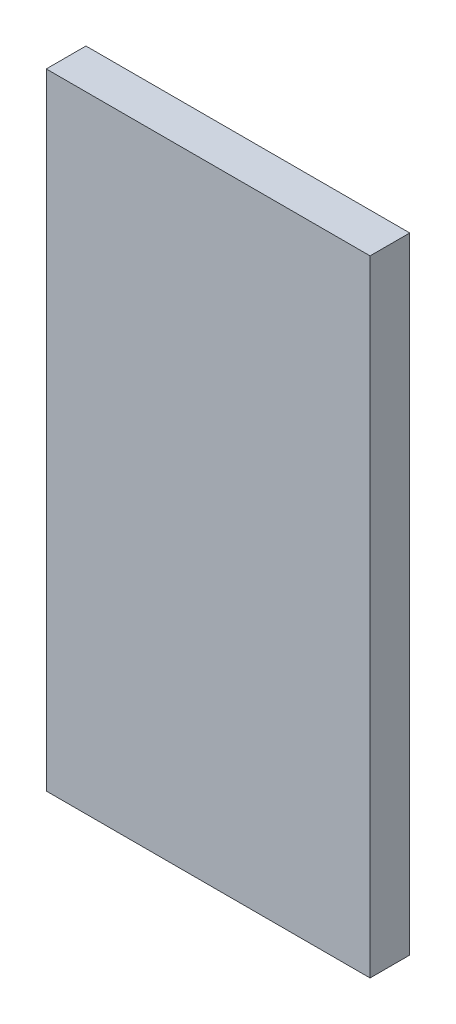
ISO-10303-21;
HEADER;
FILE_DESCRIPTION(('STEP AP214'),'2;1');
FILE_NAME('part.step','',(''),(''),'','','');
FILE_SCHEMA(('AUTOMOTIVE_DESIGN { 1 0 10303 214 1 1 1 1 }'));
ENDSEC;
DATA;
#1=APPLICATION_CONTEXT('core data for automotive mechanical design processes');
#2=APPLICATION_PROTOCOL_DEFINITION('international standard','automotive_design',2000,#1);
#3=PRODUCT_CONTEXT('',#1,'mechanical');
#4=PRODUCT('Part','Part','',(#3));
#5=PRODUCT_RELATED_PRODUCT_CATEGORY('part','',(#4));
#6=PRODUCT_DEFINITION_FORMATION('','',#4);
#7=PRODUCT_DEFINITION_CONTEXT('part definition',#1,'design');
#8=PRODUCT_DEFINITION('design','',#6,#7);
#9=PRODUCT_DEFINITION_SHAPE('','',#8);
#10=(LENGTH_UNIT() NAMED_UNIT(*) SI_UNIT(.MILLI.,.METRE.));
#11=(NAMED_UNIT(*) PLANE_ANGLE_UNIT() SI_UNIT($,.RADIAN.));
#12=(NAMED_UNIT(*) SI_UNIT($,.STERADIAN.) SOLID_ANGLE_UNIT());
#13=UNCERTAINTY_MEASURE_WITH_UNIT(LENGTH_MEASURE(1.E-05),#10,'distance_accuracy_value','');
#14=(GEOMETRIC_REPRESENTATION_CONTEXT(3) GLOBAL_UNCERTAINTY_ASSIGNED_CONTEXT((#13)) GLOBAL_UNIT_ASSIGNED_CONTEXT((#10,
#11,#12)) REPRESENTATION_CONTEXT('',''));
#15=CARTESIAN_POINT('',(0.,0.,0.));
#16=DIRECTION('',(0.,0.,1.));
#17=DIRECTION('',(1.,0.,0.));
#18=AXIS2_PLACEMENT_3D('',#15,#16,#17);
#19=CARTESIAN_POINT('',(-5.488,-3.698,0.1));
#20=DIRECTION('',(0.,0.,1.));
#21=DIRECTION('',(1.,0.,0.));
#22=AXIS2_PLACEMENT_3D('',#19,#20,#21);
#23=PLANE('',#22);
#24=DIRECTION('',(0.,1.,0.));
#25=VECTOR('',#24,1.);
#26=CARTESIAN_POINT('',(-4.672,-3.698,0.1));
#27=LINE('',#26,#25);
#28=CARTESIAN_POINT('',(-4.672,-2.122,0.1));
#29=VERTEX_POINT('',#28);
#30=CARTESIAN_POINT('',(-4.672,-3.698,0.1));
#31=VERTEX_POINT('',#30);
#32=EDGE_CURVE('E75',#29,#31,#27,.F.);
#33=ORIENTED_EDGE('',*,*,#32,.F.);
#34=DIRECTION('',(1.,0.,0.));
#35=VECTOR('',#34,1.);
#36=CARTESIAN_POINT('',(-5.488,-2.122,0.1));
#37=LINE('',#36,#35);
#38=CARTESIAN_POINT('',(-5.488,-2.122,0.1));
#39=VERTEX_POINT('',#38);
#40=EDGE_CURVE('E57',#39,#29,#37,.T.);
#41=ORIENTED_EDGE('',*,*,#40,.F.);
#42=DIRECTION('',(0.,1.,0.));
#43=VECTOR('',#42,1.);
#44=CARTESIAN_POINT('',(-5.488,-3.698,0.1));
#45=LINE('',#44,#43);
#46=CARTESIAN_POINT('',(-5.488,-3.698,0.1));
#47=VERTEX_POINT('',#46);
#48=EDGE_CURVE('E19',#39,#47,#45,.F.);
#49=ORIENTED_EDGE('',*,*,#48,.T.);
#50=DIRECTION('',(1.,0.,0.));
#51=VECTOR('',#50,1.);
#52=CARTESIAN_POINT('',(-5.488,-3.698,0.1));
#53=LINE('',#52,#51);
#54=EDGE_CURVE('E54',#47,#31,#53,.T.);
#55=ORIENTED_EDGE('',*,*,#54,.T.);
#56=EDGE_LOOP('',(#33,#41,#49,#55));
#57=FACE_BOUND('',#56,.T.);
#58=ADVANCED_FACE('F16',(#57),#23,.T.);
#59=CARTESIAN_POINT('',(-5.488,-3.698,0.));
#60=DIRECTION('',(1.,0.,0.));
#61=DIRECTION('',(0.,0.,-1.));
#62=AXIS2_PLACEMENT_3D('',#59,#60,#61);
#63=PLANE('',#62);
#64=DIRECTION('',(0.,0.,1.));
#65=VECTOR('',#64,1.);
#66=CARTESIAN_POINT('',(-5.488,-2.122,0.));
#67=LINE('',#66,#65);
#68=CARTESIAN_POINT('',(-5.488,-2.122,0.));
#69=VERTEX_POINT('',#68);
#70=EDGE_CURVE('E77',#69,#39,#67,.T.);
#71=ORIENTED_EDGE('',*,*,#70,.F.);
#72=DIRECTION('',(0.,1.,0.));
#73=VECTOR('',#72,1.);
#74=CARTESIAN_POINT('',(-5.488,-3.698,0.));
#75=LINE('',#74,#73);
#76=CARTESIAN_POINT('',(-5.488,-3.698,0.));
#77=VERTEX_POINT('',#76);
#78=EDGE_CURVE('E72',#69,#77,#75,.F.);
#79=ORIENTED_EDGE('',*,*,#78,.T.);
#80=DIRECTION('',(0.,0.,1.));
#81=VECTOR('',#80,1.);
#82=CARTESIAN_POINT('',(-5.488,-3.698,0.));
#83=LINE('',#82,#81);
#84=EDGE_CURVE('E62',#77,#47,#83,.T.);
#85=ORIENTED_EDGE('',*,*,#84,.T.);
#86=ORIENTED_EDGE('',*,*,#48,.F.);
#87=EDGE_LOOP('',(#71,#79,#85,#86));
#88=FACE_BOUND('',#87,.T.);
#89=ADVANCED_FACE('F71',(#88),#63,.F.);
#90=CARTESIAN_POINT('',(-5.488,-3.698,0.));
#91=DIRECTION('',(0.,1.,0.));
#92=DIRECTION('',(0.,0.,1.));
#93=AXIS2_PLACEMENT_3D('',#90,#91,#92);
#94=PLANE('',#93);
#95=ORIENTED_EDGE('',*,*,#54,.F.);
#96=ORIENTED_EDGE('',*,*,#84,.F.);
#97=DIRECTION('',(1.,0.,0.));
#98=VECTOR('',#97,1.);
#99=CARTESIAN_POINT('',(-5.488,-3.698,0.));
#100=LINE('',#99,#98);
#101=CARTESIAN_POINT('',(-4.672,-3.698,0.));
#102=VERTEX_POINT('',#101);
#103=EDGE_CURVE('E82',#77,#102,#100,.T.);
#104=ORIENTED_EDGE('',*,*,#103,.T.);
#105=DIRECTION('',(0.,0.,-1.));
#106=VECTOR('',#105,1.);
#107=CARTESIAN_POINT('',(-4.672,-3.698,0.));
#108=LINE('',#107,#106);
#109=EDGE_CURVE('E68',#31,#102,#108,.T.);
#110=ORIENTED_EDGE('',*,*,#109,.F.);
#111=EDGE_LOOP('',(#95,#96,#104,#110));
#112=FACE_BOUND('',#111,.T.);
#113=ADVANCED_FACE('F65',(#112),#94,.F.);
#114=CARTESIAN_POINT('',(-4.672,-3.698,0.));
#115=DIRECTION('',(1.,0.,0.));
#116=DIRECTION('',(0.,0.,-1.));
#117=AXIS2_PLACEMENT_3D('',#114,#115,#116);
#118=PLANE('',#117);
#119=DIRECTION('',(0.,0.,1.));
#120=VECTOR('',#119,1.);
#121=CARTESIAN_POINT('',(-4.672,-2.122,0.));
#122=LINE('',#121,#120);
#123=CARTESIAN_POINT('',(-4.672,-2.122,0.));
#124=VERTEX_POINT('',#123);
#125=EDGE_CURVE('E33',#29,#124,#122,.F.);
#126=ORIENTED_EDGE('',*,*,#125,.F.);
#127=ORIENTED_EDGE('',*,*,#32,.T.);
#128=ORIENTED_EDGE('',*,*,#109,.T.);
#129=DIRECTION('',(0.,1.,0.));
#130=VECTOR('',#129,1.);
#131=CARTESIAN_POINT('',(-4.672,-3.698,0.));
#132=LINE('',#131,#130);
#133=EDGE_CURVE('E25',#102,#124,#132,.T.);
#134=ORIENTED_EDGE('',*,*,#133,.T.);
#135=EDGE_LOOP('',(#126,#127,#128,#134));
#136=FACE_BOUND('',#135,.T.);
#137=ADVANCED_FACE('F87',(#136),#118,.T.);
#138=CARTESIAN_POINT('',(-5.488,-2.122,0.));
#139=DIRECTION('',(0.,1.,0.));
#140=DIRECTION('',(0.,0.,1.));
#141=AXIS2_PLACEMENT_3D('',#138,#139,#140);
#142=PLANE('',#141);
#143=ORIENTED_EDGE('',*,*,#40,.T.);
#144=ORIENTED_EDGE('',*,*,#125,.T.);
#145=DIRECTION('',(1.,0.,0.));
#146=VECTOR('',#145,1.);
#147=CARTESIAN_POINT('',(-5.488,-2.122,0.));
#148=LINE('',#147,#146);
#149=EDGE_CURVE('E11',#124,#69,#148,.F.);
#150=ORIENTED_EDGE('',*,*,#149,.T.);
#151=ORIENTED_EDGE('',*,*,#70,.T.);
#152=EDGE_LOOP('',(#143,#144,#150,#151));
#153=FACE_BOUND('',#152,.T.);
#154=ADVANCED_FACE('F90',(#153),#142,.T.);
#155=CARTESIAN_POINT('',(-5.488,-3.698,0.));
#156=DIRECTION('',(0.,0.,1.));
#157=DIRECTION('',(1.,0.,0.));
#158=AXIS2_PLACEMENT_3D('',#155,#156,#157);
#159=PLANE('',#158);
#160=ORIENTED_EDGE('',*,*,#133,.F.);
#161=ORIENTED_EDGE('',*,*,#103,.F.);
#162=ORIENTED_EDGE('',*,*,#78,.F.);
#163=ORIENTED_EDGE('',*,*,#149,.F.);
#164=EDGE_LOOP('',(#160,#161,#162,#163));
#165=FACE_BOUND('',#164,.T.);
#166=ADVANCED_FACE('F89',(#165),#159,.F.);
#167=CLOSED_SHELL('',(#58,#89,#113,#137,#154,#166));
#168=MANIFOLD_SOLID_BREP('B1',#167);
#169=ADVANCED_BREP_SHAPE_REPRESENTATION('',(#18,#168),#14);
#170=SHAPE_DEFINITION_REPRESENTATION(#9,#169);
ENDSEC;
END-ISO-10303-21;
